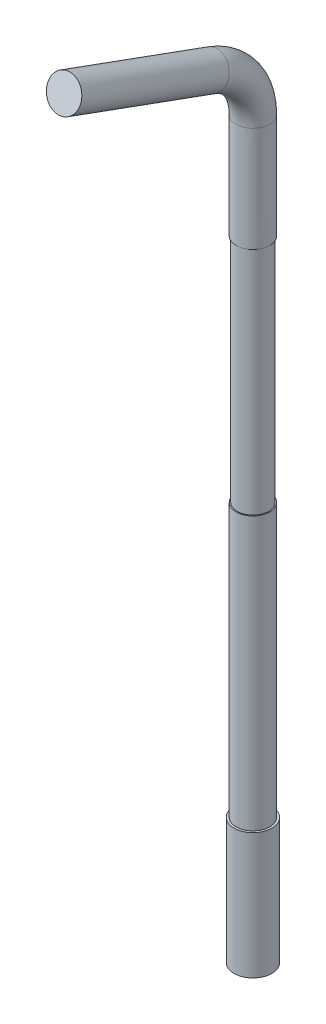
ISO-10303-21;
HEADER;
FILE_DESCRIPTION(('STEP AP214'),'2;1');
FILE_NAME('part.step','',(''),(''),'','','');
FILE_SCHEMA(('AUTOMOTIVE_DESIGN { 1 0 10303 214 1 1 1 1 }'));
ENDSEC;
DATA;
#1=APPLICATION_CONTEXT('core data for automotive mechanical design processes');
#2=APPLICATION_PROTOCOL_DEFINITION('international standard','automotive_design',2000,#1);
#3=PRODUCT_CONTEXT('',#1,'mechanical');
#4=PRODUCT('Part','Part','',(#3));
#5=PRODUCT_RELATED_PRODUCT_CATEGORY('part','',(#4));
#6=PRODUCT_DEFINITION_FORMATION('','',#4);
#7=PRODUCT_DEFINITION_CONTEXT('part definition',#1,'design');
#8=PRODUCT_DEFINITION('design','',#6,#7);
#9=PRODUCT_DEFINITION_SHAPE('','',#8);
#10=(LENGTH_UNIT() NAMED_UNIT(*) SI_UNIT(.MILLI.,.METRE.));
#11=(NAMED_UNIT(*) PLANE_ANGLE_UNIT() SI_UNIT($,.RADIAN.));
#12=(NAMED_UNIT(*) SI_UNIT($,.STERADIAN.) SOLID_ANGLE_UNIT());
#13=UNCERTAINTY_MEASURE_WITH_UNIT(LENGTH_MEASURE(1.E-05),#10,'distance_accuracy_value','');
#14=(GEOMETRIC_REPRESENTATION_CONTEXT(3) GLOBAL_UNCERTAINTY_ASSIGNED_CONTEXT((#13)) GLOBAL_UNIT_ASSIGNED_CONTEXT((#10,
#11,#12)) REPRESENTATION_CONTEXT('',''));
#15=CARTESIAN_POINT('',(0.,0.,0.));
#16=DIRECTION('',(0.,0.,1.));
#17=DIRECTION('',(1.,0.,0.));
#18=AXIS2_PLACEMENT_3D('',#15,#16,#17);
#19=CARTESIAN_POINT('',(0.,37.8190778623577,9.473939570023));
#20=DIRECTION('',(0.,0.342020143325665,0.93969262078591));
#21=DIRECTION('',(0.,-0.93969262078591,0.342020143325665));
#22=AXIS2_PLACEMENT_3D('',#19,#20,#21);
#23=CYLINDRICAL_SURFACE('',#22,0.8);
#24=CARTESIAN_POINT('',(0.,37.8190778623577,9.473939570023));
#25=DIRECTION('',(0.,0.342020143325665,0.93969262078591));
#26=DIRECTION('',(0.,-0.93969262078591,0.342020143325665));
#27=AXIS2_PLACEMENT_3D('',#24,#25,#26);
#28=CIRCLE('',#27,0.8);
#29=CARTESIAN_POINT('',(0.,38.5708319589865,9.20032345536247));
#30=VERTEX_POINT('',#29);
#31=EDGE_CURVE('E38',#30,#30,#28,.T.);
#32=ORIENTED_EDGE('',*,*,#31,.T.);
#33=EDGE_LOOP('',(#32));
#34=FACE_BOUND('',#33,.T.);
#35=CARTESIAN_POINT('',(0.,40.3763547230249,16.5));
#36=DIRECTION('',(0.,0.342020143325665,0.93969262078591));
#37=DIRECTION('',(0.,-0.93969262078591,0.342020143325665));
#38=AXIS2_PLACEMENT_3D('',#35,#36,#37);
#39=CIRCLE('',#38,0.8);
#40=CARTESIAN_POINT('',(0.,39.6246006263962,16.7736161146605));
#41=VERTEX_POINT('',#40);
#42=EDGE_CURVE('E11',#41,#41,#39,.T.);
#43=ORIENTED_EDGE('',*,*,#42,.F.);
#44=EDGE_LOOP('',(#43));
#45=FACE_BOUND('',#44,.T.);
#46=ADVANCED_FACE('F31',(#34,#45),#23,.T.);
#47=CARTESIAN_POINT('',(0.,35.,10.5));
#48=DIRECTION('',(1.,0.,0.));
#49=DIRECTION('',(0.,0.,-1.));
#50=AXIS2_PLACEMENT_3D('',#47,#48,#49);
#51=TOROIDAL_SURFACE('',#50,3.,0.8);
#52=CARTESIAN_POINT('',(0.,35.,7.5));
#53=DIRECTION('',(0.,1.,0.));
#54=DIRECTION('',(0.,0.,1.));
#55=AXIS2_PLACEMENT_3D('',#52,#53,#54);
#56=CIRCLE('',#55,0.8);
#57=CARTESIAN_POINT('',(0.,35.,6.7));
#58=VERTEX_POINT('',#57);
#59=EDGE_CURVE('E43',#58,#58,#56,.T.);
#60=CARTESIAN_POINT('',(0.,35.,10.5));
#61=DIRECTION('',(1.,0.,0.));
#62=DIRECTION('',(0.,0.,-1.));
#63=AXIS2_PLACEMENT_3D('',#60,#61,#62);
#64=CIRCLE('',#63,3.8);
#65=EDGE_CURVE('',#58,#30,#64,.T.);
#66=ORIENTED_EDGE('',*,*,#59,.T.);
#67=ORIENTED_EDGE('',*,*,#31,.F.);
#68=ORIENTED_EDGE('',*,*,#65,.T.);
#69=ORIENTED_EDGE('',*,*,#65,.F.);
#70=EDGE_LOOP('',(#66,#68,#67,#69));
#71=FACE_BOUND('',#70,.T.);
#72=ADVANCED_FACE('F71',(#71),#51,.T.);
#73=CARTESIAN_POINT('',(0.,35.,7.5));
#74=DIRECTION('',(0.,-1.,0.));
#75=DIRECTION('',(0.,0.,-1.));
#76=AXIS2_PLACEMENT_3D('',#73,#74,#75);
#77=CYLINDRICAL_SURFACE('',#76,0.8);
#78=CARTESIAN_POINT('',(0.,30.,7.5));
#79=DIRECTION('',(0.,1.,0.));
#80=DIRECTION('',(0.,0.,1.));
#81=AXIS2_PLACEMENT_3D('',#78,#79,#80);
#82=CIRCLE('',#81,0.8);
#83=CARTESIAN_POINT('',(0.,30.,8.3));
#84=VERTEX_POINT('',#83);
#85=EDGE_CURVE('E34',#84,#84,#82,.T.);
#86=ORIENTED_EDGE('',*,*,#85,.T.);
#87=EDGE_LOOP('',(#86));
#88=FACE_BOUND('',#87,.T.);
#89=ORIENTED_EDGE('',*,*,#59,.F.);
#90=EDGE_LOOP('',(#89));
#91=FACE_BOUND('',#90,.T.);
#92=ADVANCED_FACE('F74',(#88,#91),#77,.T.);
#93=CARTESIAN_POINT('',(0.,40.3763547230249,16.5));
#94=DIRECTION('',(0.,0.342020143325665,0.93969262078591));
#95=DIRECTION('',(0.,-0.93969262078591,0.342020143325665));
#96=AXIS2_PLACEMENT_3D('',#93,#94,#95);
#97=PLANE('',#96);
#98=ORIENTED_EDGE('',*,*,#42,.T.);
#99=EDGE_LOOP('',(#98));
#100=FACE_BOUND('',#99,.T.);
#101=ADVANCED_FACE('F76',(#100),#97,.T.);
#102=CARTESIAN_POINT('',(0.,30.,11.6868080573303));
#103=DIRECTION('',(0.,1.,0.));
#104=DIRECTION('',(0.,0.,1.));
#105=AXIS2_PLACEMENT_3D('',#102,#103,#104);
#106=PLANE('',#105);
#107=CARTESIAN_POINT('',(0.,30.,7.5));
#108=DIRECTION('',(0.,1.,0.));
#109=DIRECTION('',(0.,0.,1.));
#110=AXIS2_PLACEMENT_3D('',#107,#108,#109);
#111=CIRCLE('',#110,0.75);
#112=CARTESIAN_POINT('',(0.,30.,8.25));
#113=VERTEX_POINT('',#112);
#114=EDGE_CURVE('E52',#113,#113,#111,.T.);
#115=ORIENTED_EDGE('',*,*,#114,.T.);
#116=EDGE_LOOP('',(#115));
#117=FACE_BOUND('',#116,.T.);
#118=ORIENTED_EDGE('',*,*,#85,.F.);
#119=EDGE_LOOP('',(#118));
#120=FACE_BOUND('',#119,.T.);
#121=ADVANCED_FACE('F84',(#117,#120),#106,.F.);
#122=CARTESIAN_POINT('',(0.,19.,11.6868080573303));
#123=DIRECTION('',(0.,1.,0.));
#124=DIRECTION('',(0.,0.,1.));
#125=AXIS2_PLACEMENT_3D('',#122,#123,#124);
#126=PLANE('',#125);
#127=CARTESIAN_POINT('',(0.,19.,7.5));
#128=DIRECTION('',(0.,1.,0.));
#129=DIRECTION('',(0.,0.,1.));
#130=AXIS2_PLACEMENT_3D('',#127,#128,#129);
#131=CIRCLE('',#130,0.75);
#132=CARTESIAN_POINT('',(0.,19.,8.25));
#133=VERTEX_POINT('',#132);
#134=EDGE_CURVE('E58',#133,#133,#131,.T.);
#135=ORIENTED_EDGE('',*,*,#134,.F.);
#136=EDGE_LOOP('',(#135));
#137=FACE_BOUND('',#136,.T.);
#138=CARTESIAN_POINT('',(0.,19.,7.5));
#139=DIRECTION('',(0.,1.,0.));
#140=DIRECTION('',(0.,0.,1.));
#141=AXIS2_PLACEMENT_3D('',#138,#139,#140);
#142=CIRCLE('',#141,0.8);
#143=CARTESIAN_POINT('',(0.,19.,8.3));
#144=VERTEX_POINT('',#143);
#145=EDGE_CURVE('E50',#144,#144,#142,.T.);
#146=ORIENTED_EDGE('',*,*,#145,.T.);
#147=EDGE_LOOP('',(#146));
#148=FACE_BOUND('',#147,.T.);
#149=ADVANCED_FACE('F151',(#137,#148),#126,.T.);
#150=CARTESIAN_POINT('',(0.,30.,7.5));
#151=DIRECTION('',(0.,-1.,0.));
#152=DIRECTION('',(0.,0.,-1.));
#153=AXIS2_PLACEMENT_3D('',#150,#151,#152);
#154=CYLINDRICAL_SURFACE('',#153,0.75);
#155=ORIENTED_EDGE('',*,*,#114,.F.);
#156=EDGE_LOOP('',(#155));
#157=FACE_BOUND('',#156,.T.);
#158=ORIENTED_EDGE('',*,*,#134,.T.);
#159=EDGE_LOOP('',(#158));
#160=FACE_BOUND('',#159,.T.);
#161=ADVANCED_FACE('F137',(#157,#160),#154,.T.);
#162=CARTESIAN_POINT('',(0.,0.,7.49999999999999));
#163=DIRECTION('',(0.,1.,0.));
#164=DIRECTION('',(0.,0.,1.));
#165=AXIS2_PLACEMENT_3D('',#162,#163,#164);
#166=PLANE('',#165);
#167=CARTESIAN_POINT('',(0.,0.,7.5));
#168=DIRECTION('',(0.,1.,0.));
#169=DIRECTION('',(0.,0.,1.));
#170=AXIS2_PLACEMENT_3D('',#167,#168,#169);
#171=CIRCLE('',#170,0.899999999999999);
#172=CARTESIAN_POINT('',(0.,0.,8.4));
#173=VERTEX_POINT('',#172);
#174=EDGE_CURVE('E56',#173,#173,#171,.T.);
#175=ORIENTED_EDGE('',*,*,#174,.F.);
#176=EDGE_LOOP('',(#175));
#177=FACE_BOUND('',#176,.T.);
#178=ADVANCED_FACE('F128',(#177),#166,.F.);
#179=CARTESIAN_POINT('',(0.,6.,7.5));
#180=DIRECTION('',(0.,-1.,0.));
#181=DIRECTION('',(0.,0.,-1.));
#182=AXIS2_PLACEMENT_3D('',#179,#180,#181);
#183=CYLINDRICAL_SURFACE('',#182,0.899999999999999);
#184=CARTESIAN_POINT('',(0.,6.,7.5));
#185=DIRECTION('',(0.,1.,0.));
#186=DIRECTION('',(0.,0.,1.));
#187=AXIS2_PLACEMENT_3D('',#184,#185,#186);
#188=CIRCLE('',#187,0.899999999999999);
#189=CARTESIAN_POINT('',(0.,6.,8.4));
#190=VERTEX_POINT('',#189);
#191=EDGE_CURVE('E49',#190,#190,#188,.T.);
#192=ORIENTED_EDGE('',*,*,#191,.F.);
#193=EDGE_LOOP('',(#192));
#194=FACE_BOUND('',#193,.T.);
#195=ORIENTED_EDGE('',*,*,#174,.T.);
#196=EDGE_LOOP('',(#195));
#197=FACE_BOUND('',#196,.T.);
#198=ADVANCED_FACE('F118',(#194,#197),#183,.T.);
#199=CARTESIAN_POINT('',(0.,6.,7.5));
#200=DIRECTION('',(0.,1.,0.));
#201=DIRECTION('',(0.,0.,1.));
#202=AXIS2_PLACEMENT_3D('',#199,#200,#201);
#203=PLANE('',#202);
#204=ORIENTED_EDGE('',*,*,#191,.T.);
#205=EDGE_LOOP('',(#204));
#206=FACE_BOUND('',#205,.T.);
#207=CARTESIAN_POINT('',(0.,6.,7.49999999999999));
#208=DIRECTION('',(0.,1.,0.));
#209=DIRECTION('',(0.,0.,1.));
#210=AXIS2_PLACEMENT_3D('',#207,#208,#209);
#211=CIRCLE('',#210,0.8);
#212=CARTESIAN_POINT('',(0.,6.,8.3));
#213=VERTEX_POINT('',#212);
#214=EDGE_CURVE('E47',#213,#213,#211,.T.);
#215=ORIENTED_EDGE('',*,*,#214,.F.);
#216=EDGE_LOOP('',(#215));
#217=FACE_BOUND('',#216,.T.);
#218=ADVANCED_FACE('F88',(#206,#217),#203,.T.);
#219=ORIENTED_EDGE('',*,*,#214,.T.);
#220=EDGE_LOOP('',(#219));
#221=FACE_BOUND('',#220,.T.);
#222=ORIENTED_EDGE('',*,*,#145,.F.);
#223=EDGE_LOOP('',(#222));
#224=FACE_BOUND('',#223,.T.);
#225=ADVANCED_FACE('F79',(#221,#224),#77,.T.);
#226=CLOSED_SHELL('',(#46,#72,#92,#101,#121,#149,#161,#178,#198,#218,#225));
#227=MANIFOLD_SOLID_BREP('B2',#226);
#228=ADVANCED_BREP_SHAPE_REPRESENTATION('',(#18,#227),#14);
#229=SHAPE_DEFINITION_REPRESENTATION(#9,#228);
ENDSEC;
END-ISO-10303-21;
